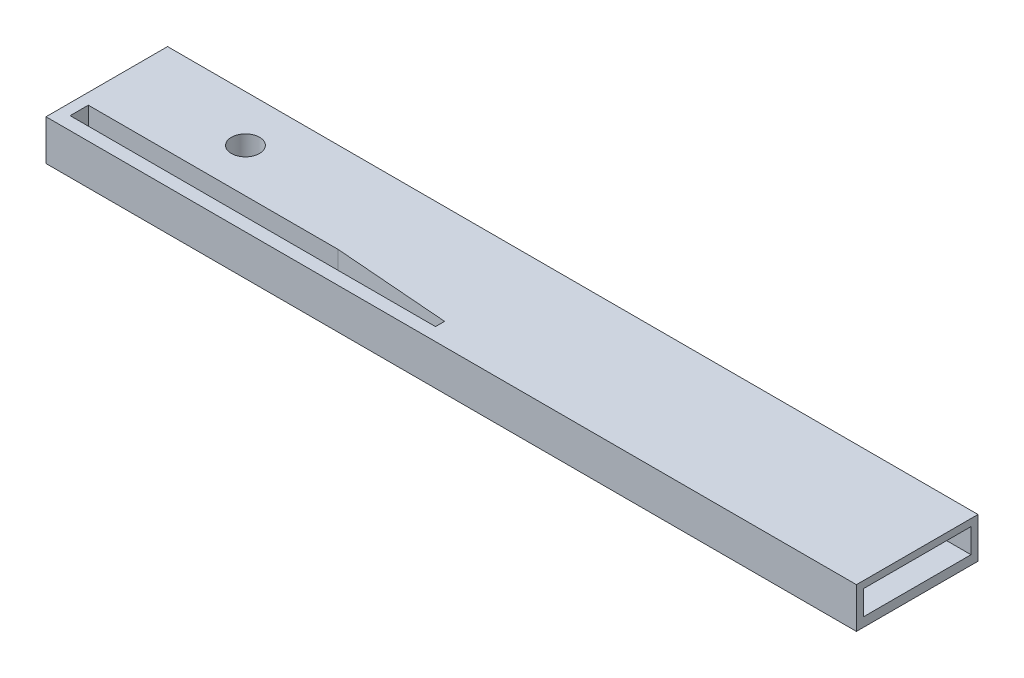
ISO-10303-21;
HEADER;
FILE_DESCRIPTION(('STEP AP214'),'2;1');
FILE_NAME('part.step','',(''),(''),'','','');
FILE_SCHEMA(('AUTOMOTIVE_DESIGN { 1 0 10303 214 1 1 1 1 }'));
ENDSEC;
DATA;
#1=APPLICATION_CONTEXT('core data for automotive mechanical design processes');
#2=APPLICATION_PROTOCOL_DEFINITION('international standard','automotive_design',2000,#1);
#3=PRODUCT_CONTEXT('',#1,'mechanical');
#4=PRODUCT('Part','Part','',(#3));
#5=PRODUCT_RELATED_PRODUCT_CATEGORY('part','',(#4));
#6=PRODUCT_DEFINITION_FORMATION('','',#4);
#7=PRODUCT_DEFINITION_CONTEXT('part definition',#1,'design');
#8=PRODUCT_DEFINITION('design','',#6,#7);
#9=PRODUCT_DEFINITION_SHAPE('','',#8);
#10=(LENGTH_UNIT() NAMED_UNIT(*) SI_UNIT(.MILLI.,.METRE.));
#11=(NAMED_UNIT(*) PLANE_ANGLE_UNIT() SI_UNIT($,.RADIAN.));
#12=(NAMED_UNIT(*) SI_UNIT($,.STERADIAN.) SOLID_ANGLE_UNIT());
#13=UNCERTAINTY_MEASURE_WITH_UNIT(LENGTH_MEASURE(1.E-05),#10,'distance_accuracy_value','');
#14=(GEOMETRIC_REPRESENTATION_CONTEXT(3) GLOBAL_UNCERTAINTY_ASSIGNED_CONTEXT((#13)) GLOBAL_UNIT_ASSIGNED_CONTEXT((#10,
#11,#12)) REPRESENTATION_CONTEXT('',''));
#15=CARTESIAN_POINT('',(0.,0.,0.));
#16=DIRECTION('',(0.,0.,1.));
#17=DIRECTION('',(1.,0.,0.));
#18=AXIS2_PLACEMENT_3D('',#15,#16,#17);
#19=CARTESIAN_POINT('',(63.5,6.35,-9.525));
#20=DIRECTION('',(-1.,0.,0.));
#21=DIRECTION('',(0.,0.,1.));
#22=AXIS2_PLACEMENT_3D('',#19,#20,#21);
#23=PLANE('',#22);
#24=DIRECTION('',(0.,0.,1.));
#25=VECTOR('',#24,1.);
#26=CARTESIAN_POINT('',(63.5,5.25234773855068,8.42866450856745));
#27=LINE('',#26,#25);
#28=CARTESIAN_POINT('',(63.5,5.25234773855068,-8.42866450856745));
#29=VERTEX_POINT('',#28);
#30=CARTESIAN_POINT('',(63.5,5.25234773855068,8.42866450856745));
#31=VERTEX_POINT('',#30);
#32=EDGE_CURVE('E191',#29,#31,#27,.T.);
#33=ORIENTED_EDGE('',*,*,#32,.F.);
#34=DIRECTION('',(0.,1.,0.));
#35=VECTOR('',#34,1.);
#36=CARTESIAN_POINT('',(63.5,5.25234773855068,-8.42866450856745));
#37=LINE('',#36,#35);
#38=CARTESIAN_POINT('',(63.5,1.43559399882202,-8.42866450856745));
#39=VERTEX_POINT('',#38);
#40=EDGE_CURVE('E170',#39,#29,#37,.T.);
#41=ORIENTED_EDGE('',*,*,#40,.F.);
#42=DIRECTION('',(0.,0.,-1.));
#43=VECTOR('',#42,1.);
#44=CARTESIAN_POINT('',(63.5,1.43559399882202,8.42866450856745));
#45=LINE('',#44,#43);
#46=CARTESIAN_POINT('',(63.5,1.43559399882202,8.42866450856745));
#47=VERTEX_POINT('',#46);
#48=EDGE_CURVE('E180',#47,#39,#45,.T.);
#49=ORIENTED_EDGE('',*,*,#48,.F.);
#50=DIRECTION('',(0.,-1.,0.));
#51=VECTOR('',#50,1.);
#52=CARTESIAN_POINT('',(63.5,5.25234773855068,8.42866450856745));
#53=LINE('',#52,#51);
#54=EDGE_CURVE('E194',#31,#47,#53,.T.);
#55=ORIENTED_EDGE('',*,*,#54,.F.);
#56=EDGE_LOOP('',(#33,#41,#49,#55));
#57=FACE_BOUND('',#56,.T.);
#58=DIRECTION('',(0.,0.,-1.));
#59=VECTOR('',#58,1.);
#60=CARTESIAN_POINT('',(63.5,0.,-9.525));
#61=LINE('',#60,#59);
#62=CARTESIAN_POINT('',(63.5,0.,9.525));
#63=VERTEX_POINT('',#62);
#64=CARTESIAN_POINT('',(63.5,0.,-9.525));
#65=VERTEX_POINT('',#64);
#66=EDGE_CURVE('E201',#63,#65,#61,.T.);
#67=ORIENTED_EDGE('',*,*,#66,.T.);
#68=DIRECTION('',(0.,-1.,0.));
#69=VECTOR('',#68,1.);
#70=CARTESIAN_POINT('',(63.5,6.35,-9.525));
#71=LINE('',#70,#69);
#72=CARTESIAN_POINT('',(63.5,6.35,-9.525));
#73=VERTEX_POINT('',#72);
#74=EDGE_CURVE('E11',#73,#65,#71,.T.);
#75=ORIENTED_EDGE('',*,*,#74,.F.);
#76=DIRECTION('',(0.,0.,-1.));
#77=VECTOR('',#76,1.);
#78=CARTESIAN_POINT('',(63.5,6.35,-9.525));
#79=LINE('',#78,#77);
#80=CARTESIAN_POINT('',(63.5,6.35,9.525));
#81=VERTEX_POINT('',#80);
#82=EDGE_CURVE('E208',#81,#73,#79,.T.);
#83=ORIENTED_EDGE('',*,*,#82,.F.);
#84=DIRECTION('',(0.,-1.,0.));
#85=VECTOR('',#84,1.);
#86=CARTESIAN_POINT('',(63.5,6.35,9.525));
#87=LINE('',#86,#85);
#88=EDGE_CURVE('E218',#81,#63,#87,.T.);
#89=ORIENTED_EDGE('',*,*,#88,.T.);
#90=EDGE_LOOP('',(#67,#75,#83,#89));
#91=FACE_BOUND('',#90,.T.);
#92=ADVANCED_FACE('F33',(#57,#91),#23,.F.);
#93=CARTESIAN_POINT('',(-63.5,6.35,-9.525));
#94=DIRECTION('',(0.,0.,1.));
#95=DIRECTION('',(1.,0.,0.));
#96=AXIS2_PLACEMENT_3D('',#93,#94,#95);
#97=PLANE('',#96);
#98=DIRECTION('',(-1.,0.,0.));
#99=VECTOR('',#98,1.);
#100=CARTESIAN_POINT('',(-63.5,0.,-9.525));
#101=LINE('',#100,#99);
#102=CARTESIAN_POINT('',(-63.5,0.,-9.525));
#103=VERTEX_POINT('',#102);
#104=EDGE_CURVE('E221',#65,#103,#101,.T.);
#105=ORIENTED_EDGE('',*,*,#104,.T.);
#106=DIRECTION('',(0.,-1.,0.));
#107=VECTOR('',#106,1.);
#108=CARTESIAN_POINT('',(-63.5,6.35,-9.525));
#109=LINE('',#108,#107);
#110=CARTESIAN_POINT('',(-63.5,6.35,-9.525));
#111=VERTEX_POINT('',#110);
#112=EDGE_CURVE('E40',#111,#103,#109,.T.);
#113=ORIENTED_EDGE('',*,*,#112,.F.);
#114=DIRECTION('',(-1.,0.,0.));
#115=VECTOR('',#114,1.);
#116=CARTESIAN_POINT('',(-63.5,6.35,-9.525));
#117=LINE('',#116,#115);
#118=EDGE_CURVE('E211',#73,#111,#117,.T.);
#119=ORIENTED_EDGE('',*,*,#118,.F.);
#120=ORIENTED_EDGE('',*,*,#74,.T.);
#121=EDGE_LOOP('',(#105,#113,#119,#120));
#122=FACE_BOUND('',#121,.T.);
#123=ADVANCED_FACE('F249',(#122),#97,.F.);
#124=CARTESIAN_POINT('',(-63.5,6.35,-9.525));
#125=DIRECTION('',(1.,0.,0.));
#126=DIRECTION('',(0.,0.,-1.));
#127=AXIS2_PLACEMENT_3D('',#124,#125,#126);
#128=PLANE('',#127);
#129=DIRECTION('',(0.,0.,1.));
#130=VECTOR('',#129,1.);
#131=CARTESIAN_POINT('',(-63.5,0.,-9.525));
#132=LINE('',#131,#130);
#133=CARTESIAN_POINT('',(-63.5,0.,9.525));
#134=VERTEX_POINT('',#133);
#135=EDGE_CURVE('E223',#103,#134,#132,.T.);
#136=ORIENTED_EDGE('',*,*,#135,.T.);
#137=DIRECTION('',(0.,-1.,0.));
#138=VECTOR('',#137,1.);
#139=CARTESIAN_POINT('',(-63.5,6.35,9.525));
#140=LINE('',#139,#138);
#141=CARTESIAN_POINT('',(-63.5,6.35,9.525));
#142=VERTEX_POINT('',#141);
#143=EDGE_CURVE('E228',#142,#134,#140,.T.);
#144=ORIENTED_EDGE('',*,*,#143,.F.);
#145=DIRECTION('',(0.,0.,1.));
#146=VECTOR('',#145,1.);
#147=CARTESIAN_POINT('',(-63.5,6.35,-9.525));
#148=LINE('',#147,#146);
#149=EDGE_CURVE('E214',#111,#142,#148,.T.);
#150=ORIENTED_EDGE('',*,*,#149,.F.);
#151=ORIENTED_EDGE('',*,*,#112,.T.);
#152=EDGE_LOOP('',(#136,#144,#150,#151));
#153=FACE_BOUND('',#152,.T.);
#154=ADVANCED_FACE('F235',(#153),#128,.F.);
#155=CARTESIAN_POINT('',(-63.5,6.35,9.525));
#156=DIRECTION('',(0.,0.,-1.));
#157=DIRECTION('',(-1.,0.,0.));
#158=AXIS2_PLACEMENT_3D('',#155,#156,#157);
#159=PLANE('',#158);
#160=DIRECTION('',(1.,0.,0.));
#161=VECTOR('',#160,1.);
#162=CARTESIAN_POINT('',(-63.5,0.,9.525));
#163=LINE('',#162,#161);
#164=EDGE_CURVE('E212',#134,#63,#163,.T.);
#165=ORIENTED_EDGE('',*,*,#164,.T.);
#166=ORIENTED_EDGE('',*,*,#88,.F.);
#167=DIRECTION('',(1.,0.,0.));
#168=VECTOR('',#167,1.);
#169=CARTESIAN_POINT('',(-63.5,6.35,9.525));
#170=LINE('',#169,#168);
#171=EDGE_CURVE('E216',#142,#81,#170,.T.);
#172=ORIENTED_EDGE('',*,*,#171,.F.);
#173=ORIENTED_EDGE('',*,*,#143,.T.);
#174=EDGE_LOOP('',(#165,#166,#172,#173));
#175=FACE_BOUND('',#174,.T.);
#176=ADVANCED_FACE('F242',(#175),#159,.F.);
#177=CARTESIAN_POINT('',(0.,6.35,0.));
#178=DIRECTION('',(0.,1.,0.));
#179=DIRECTION('',(0.,0.,1.));
#180=AXIS2_PLACEMENT_3D('',#177,#178,#179);
#181=PLANE('',#180);
#182=CARTESIAN_POINT('',(-43.9861623077586,6.35,-2.21493744615281));
#183=DIRECTION('',(0.,1.,0.));
#184=DIRECTION('',(0.,0.,1.));
#185=AXIS2_PLACEMENT_3D('',#182,#183,#184);
#186=CIRCLE('',#185,2.20805835631743);
#187=CARTESIAN_POINT('',(-43.9861623077586,6.35,-0.00687908983537482));
#188=VERTEX_POINT('',#187);
#189=EDGE_CURVE('E152',#188,#188,#186,.T.);
#190=ORIENTED_EDGE('',*,*,#189,.F.);
#191=EDGE_LOOP('',(#190));
#192=FACE_BOUND('',#191,.T.);
#193=DIRECTION('',(0.,0.,1.));
#194=VECTOR('',#193,1.);
#195=CARTESIAN_POINT('',(-61.757195927554,6.35,4.6364283922186));
#196=LINE('',#195,#194);
#197=CARTESIAN_POINT('',(-61.757195927554,6.35,4.6364283922186));
#198=VERTEX_POINT('',#197);
#199=CARTESIAN_POINT('',(-61.757195927554,6.35,7.48772869078711));
#200=VERTEX_POINT('',#199);
#201=EDGE_CURVE('E47',#198,#200,#196,.T.);
#202=ORIENTED_EDGE('',*,*,#201,.F.);
#203=DIRECTION('',(-1.,0.,0.));
#204=VECTOR('',#203,1.);
#205=CARTESIAN_POINT('',(-61.757195927554,6.35,4.6364283922186));
#206=LINE('',#205,#204);
#207=CARTESIAN_POINT('',(-22.6377135339533,6.35,4.6364283922186));
#208=VERTEX_POINT('',#207);
#209=EDGE_CURVE('E146',#208,#198,#206,.T.);
#210=ORIENTED_EDGE('',*,*,#209,.F.);
#211=DIRECTION('',(-0.996923159602342,0.,-0.0783850358709056));
#212=VECTOR('',#211,1.);
#213=CARTESIAN_POINT('',(-22.6377135339533,6.35,4.6364283922186));
#214=LINE('',#213,#212);
#215=CARTESIAN_POINT('',(-4.50588983162409,6.35,6.06207854150285));
#216=VERTEX_POINT('',#215);
#217=EDGE_CURVE('E149',#216,#208,#214,.T.);
#218=ORIENTED_EDGE('',*,*,#217,.F.);
#219=DIRECTION('',(0.,0.,-1.));
#220=VECTOR('',#219,1.);
#221=CARTESIAN_POINT('',(-4.50588983162409,6.35,6.06207854150285));
#222=LINE('',#221,#220);
#223=CARTESIAN_POINT('',(-4.50588983162409,6.35,7.48772869078711));
#224=VERTEX_POINT('',#223);
#225=EDGE_CURVE('E163',#224,#216,#222,.T.);
#226=ORIENTED_EDGE('',*,*,#225,.F.);
#227=DIRECTION('',(1.,0.,0.));
#228=VECTOR('',#227,1.);
#229=CARTESIAN_POINT('',(-61.757195927554,6.35,7.48772869078711));
#230=LINE('',#229,#228);
#231=EDGE_CURVE('E160',#200,#224,#230,.T.);
#232=ORIENTED_EDGE('',*,*,#231,.F.);
#233=EDGE_LOOP('',(#202,#210,#218,#226,#232));
#234=FACE_BOUND('',#233,.T.);
#235=ORIENTED_EDGE('',*,*,#82,.T.);
#236=ORIENTED_EDGE('',*,*,#118,.T.);
#237=ORIENTED_EDGE('',*,*,#149,.T.);
#238=ORIENTED_EDGE('',*,*,#171,.T.);
#239=EDGE_LOOP('',(#235,#236,#237,#238));
#240=FACE_BOUND('',#239,.T.);
#241=ADVANCED_FACE('F248',(#192,#234,#240),#181,.T.);
#242=CARTESIAN_POINT('',(0.,0.,0.));
#243=DIRECTION('',(0.,1.,0.));
#244=DIRECTION('',(0.,0.,1.));
#245=AXIS2_PLACEMENT_3D('',#242,#243,#244);
#246=PLANE('',#245);
#247=CARTESIAN_POINT('',(-43.9861623077586,0.,-2.21493744615281));
#248=DIRECTION('',(0.,1.,0.));
#249=DIRECTION('',(0.,0.,1.));
#250=AXIS2_PLACEMENT_3D('',#247,#248,#249);
#251=CIRCLE('',#250,2.20805835631743);
#252=CARTESIAN_POINT('',(-43.9861623077586,0.,-0.00687908983537482));
#253=VERTEX_POINT('',#252);
#254=EDGE_CURVE('E161',#253,#253,#251,.T.);
#255=ORIENTED_EDGE('',*,*,#254,.T.);
#256=EDGE_LOOP('',(#255));
#257=FACE_BOUND('',#256,.T.);
#258=DIRECTION('',(-1.,0.,0.));
#259=VECTOR('',#258,1.);
#260=CARTESIAN_POINT('',(-61.757195927554,0.,4.6364283922186));
#261=LINE('',#260,#259);
#262=CARTESIAN_POINT('',(-22.6377135339533,0.,4.6364283922186));
#263=VERTEX_POINT('',#262);
#264=CARTESIAN_POINT('',(-61.757195927554,0.,4.6364283922186));
#265=VERTEX_POINT('',#264);
#266=EDGE_CURVE('E135',#263,#265,#261,.T.);
#267=ORIENTED_EDGE('',*,*,#266,.T.);
#268=DIRECTION('',(0.,0.,1.));
#269=VECTOR('',#268,1.);
#270=CARTESIAN_POINT('',(-61.757195927554,0.,4.6364283922186));
#271=LINE('',#270,#269);
#272=CARTESIAN_POINT('',(-61.757195927554,0.,7.48772869078711));
#273=VERTEX_POINT('',#272);
#274=EDGE_CURVE('E129',#265,#273,#271,.T.);
#275=ORIENTED_EDGE('',*,*,#274,.T.);
#276=DIRECTION('',(1.,0.,0.));
#277=VECTOR('',#276,1.);
#278=CARTESIAN_POINT('',(-61.757195927554,0.,7.48772869078711));
#279=LINE('',#278,#277);
#280=CARTESIAN_POINT('',(-4.50588983162409,0.,7.48772869078711));
#281=VERTEX_POINT('',#280);
#282=EDGE_CURVE('E138',#273,#281,#279,.T.);
#283=ORIENTED_EDGE('',*,*,#282,.T.);
#284=DIRECTION('',(0.,0.,-1.));
#285=VECTOR('',#284,1.);
#286=CARTESIAN_POINT('',(-4.50588983162409,0.,6.06207854150285));
#287=LINE('',#286,#285);
#288=CARTESIAN_POINT('',(-4.50588983162409,0.,6.06207854150285));
#289=VERTEX_POINT('',#288);
#290=EDGE_CURVE('E55',#281,#289,#287,.T.);
#291=ORIENTED_EDGE('',*,*,#290,.T.);
#292=DIRECTION('',(-0.996923159602342,0.,-0.0783850358709056));
#293=VECTOR('',#292,1.);
#294=CARTESIAN_POINT('',(-22.6377135339533,0.,4.6364283922186));
#295=LINE('',#294,#293);
#296=EDGE_CURVE('E156',#289,#263,#295,.T.);
#297=ORIENTED_EDGE('',*,*,#296,.T.);
#298=EDGE_LOOP('',(#267,#275,#283,#291,#297));
#299=FACE_BOUND('',#298,.T.);
#300=ORIENTED_EDGE('',*,*,#66,.F.);
#301=ORIENTED_EDGE('',*,*,#164,.F.);
#302=ORIENTED_EDGE('',*,*,#135,.F.);
#303=ORIENTED_EDGE('',*,*,#104,.F.);
#304=EDGE_LOOP('',(#300,#301,#302,#303));
#305=FACE_BOUND('',#304,.T.);
#306=ADVANCED_FACE('F142',(#257,#299,#305),#246,.F.);
#307=CARTESIAN_POINT('',(57.15,5.25234773855068,-8.42866450856745));
#308=DIRECTION('',(0.,0.,-1.));
#309=DIRECTION('',(-1.,0.,0.));
#310=AXIS2_PLACEMENT_3D('',#307,#308,#309);
#311=PLANE('',#310);
#312=ORIENTED_EDGE('',*,*,#40,.T.);
#313=DIRECTION('',(1.,0.,0.));
#314=VECTOR('',#313,1.);
#315=CARTESIAN_POINT('',(57.15,5.25234773855068,-8.42866450856745));
#316=LINE('',#315,#314);
#317=CARTESIAN_POINT('',(57.15,5.25234773855068,-8.42866450856745));
#318=VERTEX_POINT('',#317);
#319=EDGE_CURVE('E189',#318,#29,#316,.T.);
#320=ORIENTED_EDGE('',*,*,#319,.F.);
#321=DIRECTION('',(0.,1.,0.));
#322=VECTOR('',#321,1.);
#323=CARTESIAN_POINT('',(57.15,5.25234773855068,-8.42866450856745));
#324=LINE('',#323,#322);
#325=CARTESIAN_POINT('',(57.15,1.43559399882202,-8.42866450856745));
#326=VERTEX_POINT('',#325);
#327=EDGE_CURVE('E176',#326,#318,#324,.T.);
#328=ORIENTED_EDGE('',*,*,#327,.F.);
#329=DIRECTION('',(1.,0.,0.));
#330=VECTOR('',#329,1.);
#331=CARTESIAN_POINT('',(57.15,1.43559399882202,-8.42866450856745));
#332=LINE('',#331,#330);
#333=EDGE_CURVE('E199',#326,#39,#332,.T.);
#334=ORIENTED_EDGE('',*,*,#333,.T.);
#335=EDGE_LOOP('',(#312,#320,#328,#334));
#336=FACE_BOUND('',#335,.T.);
#337=ADVANCED_FACE('F262',(#336),#311,.F.);
#338=CARTESIAN_POINT('',(57.15,1.43559399882202,8.42866450856745));
#339=DIRECTION('',(0.,-1.,0.));
#340=DIRECTION('',(0.,0.,-1.));
#341=AXIS2_PLACEMENT_3D('',#338,#339,#340);
#342=PLANE('',#341);
#343=ORIENTED_EDGE('',*,*,#48,.T.);
#344=ORIENTED_EDGE('',*,*,#333,.F.);
#345=DIRECTION('',(0.,0.,-1.));
#346=VECTOR('',#345,1.);
#347=CARTESIAN_POINT('',(57.15,1.43559399882202,8.42866450856745));
#348=LINE('',#347,#346);
#349=CARTESIAN_POINT('',(57.15,1.43559399882202,8.42866450856745));
#350=VERTEX_POINT('',#349);
#351=EDGE_CURVE('E186',#350,#326,#348,.T.);
#352=ORIENTED_EDGE('',*,*,#351,.F.);
#353=DIRECTION('',(1.,0.,0.));
#354=VECTOR('',#353,1.);
#355=CARTESIAN_POINT('',(57.15,1.43559399882202,8.42866450856745));
#356=LINE('',#355,#354);
#357=EDGE_CURVE('E202',#350,#47,#356,.T.);
#358=ORIENTED_EDGE('',*,*,#357,.T.);
#359=EDGE_LOOP('',(#343,#344,#352,#358));
#360=FACE_BOUND('',#359,.T.);
#361=ADVANCED_FACE('F269',(#360),#342,.F.);
#362=CARTESIAN_POINT('',(57.15,5.25234773855068,8.42866450856745));
#363=DIRECTION('',(0.,0.,1.));
#364=DIRECTION('',(1.,0.,0.));
#365=AXIS2_PLACEMENT_3D('',#362,#363,#364);
#366=PLANE('',#365);
#367=ORIENTED_EDGE('',*,*,#54,.T.);
#368=ORIENTED_EDGE('',*,*,#357,.F.);
#369=DIRECTION('',(0.,-1.,0.));
#370=VECTOR('',#369,1.);
#371=CARTESIAN_POINT('',(57.15,5.25234773855068,8.42866450856745));
#372=LINE('',#371,#370);
#373=CARTESIAN_POINT('',(57.15,5.25234773855068,8.42866450856745));
#374=VERTEX_POINT('',#373);
#375=EDGE_CURVE('E183',#374,#350,#372,.T.);
#376=ORIENTED_EDGE('',*,*,#375,.F.);
#377=DIRECTION('',(1.,0.,0.));
#378=VECTOR('',#377,1.);
#379=CARTESIAN_POINT('',(57.15,5.25234773855068,8.42866450856745));
#380=LINE('',#379,#378);
#381=EDGE_CURVE('E204',#374,#31,#380,.T.);
#382=ORIENTED_EDGE('',*,*,#381,.T.);
#383=EDGE_LOOP('',(#367,#368,#376,#382));
#384=FACE_BOUND('',#383,.T.);
#385=ADVANCED_FACE('F275',(#384),#366,.F.);
#386=CARTESIAN_POINT('',(57.15,5.25234773855068,8.42866450856745));
#387=DIRECTION('',(0.,1.,0.));
#388=DIRECTION('',(0.,0.,1.));
#389=AXIS2_PLACEMENT_3D('',#386,#387,#388);
#390=PLANE('',#389);
#391=ORIENTED_EDGE('',*,*,#32,.T.);
#392=ORIENTED_EDGE('',*,*,#381,.F.);
#393=DIRECTION('',(0.,0.,1.));
#394=VECTOR('',#393,1.);
#395=CARTESIAN_POINT('',(57.15,5.25234773855068,8.42866450856745));
#396=LINE('',#395,#394);
#397=EDGE_CURVE('E179',#318,#374,#396,.T.);
#398=ORIENTED_EDGE('',*,*,#397,.F.);
#399=ORIENTED_EDGE('',*,*,#319,.T.);
#400=EDGE_LOOP('',(#391,#392,#398,#399));
#401=FACE_BOUND('',#400,.T.);
#402=ADVANCED_FACE('F271',(#401),#390,.F.);
#403=CARTESIAN_POINT('',(57.15,0.,0.));
#404=DIRECTION('',(1.,0.,0.));
#405=DIRECTION('',(0.,0.,-1.));
#406=AXIS2_PLACEMENT_3D('',#403,#404,#405);
#407=PLANE('',#406);
#408=ORIENTED_EDGE('',*,*,#327,.T.);
#409=ORIENTED_EDGE('',*,*,#397,.T.);
#410=ORIENTED_EDGE('',*,*,#375,.T.);
#411=ORIENTED_EDGE('',*,*,#351,.T.);
#412=EDGE_LOOP('',(#408,#409,#410,#411));
#413=FACE_BOUND('',#412,.T.);
#414=ADVANCED_FACE('F274',(#413),#407,.T.);
#415=CARTESIAN_POINT('',(-61.757195927554,0.,4.6364283922186));
#416=DIRECTION('',(-1.,0.,0.));
#417=DIRECTION('',(0.,0.,1.));
#418=AXIS2_PLACEMENT_3D('',#415,#416,#417);
#419=PLANE('',#418);
#420=ORIENTED_EDGE('',*,*,#201,.T.);
#421=DIRECTION('',(0.,1.,0.));
#422=VECTOR('',#421,1.);
#423=CARTESIAN_POINT('',(-61.757195927554,0.,7.48772869078711));
#424=LINE('',#423,#422);
#425=EDGE_CURVE('E125',#273,#200,#424,.T.);
#426=ORIENTED_EDGE('',*,*,#425,.F.);
#427=ORIENTED_EDGE('',*,*,#274,.F.);
#428=DIRECTION('',(0.,1.,0.));
#429=VECTOR('',#428,1.);
#430=CARTESIAN_POINT('',(-61.757195927554,0.,4.6364283922186));
#431=LINE('',#430,#429);
#432=EDGE_CURVE('E168',#265,#198,#431,.T.);
#433=ORIENTED_EDGE('',*,*,#432,.T.);
#434=EDGE_LOOP('',(#420,#426,#427,#433));
#435=FACE_BOUND('',#434,.T.);
#436=ADVANCED_FACE('F127',(#435),#419,.F.);
#437=CARTESIAN_POINT('',(-61.757195927554,0.,4.6364283922186));
#438=DIRECTION('',(0.,0.,-1.));
#439=DIRECTION('',(-1.,0.,0.));
#440=AXIS2_PLACEMENT_3D('',#437,#438,#439);
#441=PLANE('',#440);
#442=ORIENTED_EDGE('',*,*,#209,.T.);
#443=ORIENTED_EDGE('',*,*,#432,.F.);
#444=ORIENTED_EDGE('',*,*,#266,.F.);
#445=DIRECTION('',(0.,1.,0.));
#446=VECTOR('',#445,1.);
#447=CARTESIAN_POINT('',(-22.6377135339533,0.,4.6364283922186));
#448=LINE('',#447,#446);
#449=EDGE_CURVE('E171',#263,#208,#448,.T.);
#450=ORIENTED_EDGE('',*,*,#449,.T.);
#451=EDGE_LOOP('',(#442,#443,#444,#450));
#452=FACE_BOUND('',#451,.T.);
#453=ADVANCED_FACE('F288',(#452),#441,.F.);
#454=CARTESIAN_POINT('',(-22.6377135339533,0.,4.6364283922186));
#455=DIRECTION('',(0.0783850358709056,0.,-0.996923159602342));
#456=DIRECTION('',(-0.996923159602342,0.,-0.0783850358709056));
#457=AXIS2_PLACEMENT_3D('',#454,#455,#456);
#458=PLANE('',#457);
#459=ORIENTED_EDGE('',*,*,#217,.T.);
#460=ORIENTED_EDGE('',*,*,#449,.F.);
#461=ORIENTED_EDGE('',*,*,#296,.F.);
#462=DIRECTION('',(0.,1.,0.));
#463=VECTOR('',#462,1.);
#464=CARTESIAN_POINT('',(-4.50588983162409,0.,6.06207854150285));
#465=LINE('',#464,#463);
#466=EDGE_CURVE('E173',#289,#216,#465,.T.);
#467=ORIENTED_EDGE('',*,*,#466,.T.);
#468=EDGE_LOOP('',(#459,#460,#461,#467));
#469=FACE_BOUND('',#468,.T.);
#470=ADVANCED_FACE('F295',(#469),#458,.F.);
#471=CARTESIAN_POINT('',(-4.50588983162409,0.,6.06207854150285));
#472=DIRECTION('',(1.,0.,0.));
#473=DIRECTION('',(0.,0.,-1.));
#474=AXIS2_PLACEMENT_3D('',#471,#472,#473);
#475=PLANE('',#474);
#476=ORIENTED_EDGE('',*,*,#225,.T.);
#477=ORIENTED_EDGE('',*,*,#466,.F.);
#478=ORIENTED_EDGE('',*,*,#290,.F.);
#479=DIRECTION('',(0.,1.,0.));
#480=VECTOR('',#479,1.);
#481=CARTESIAN_POINT('',(-4.50588983162409,0.,7.48772869078711));
#482=LINE('',#481,#480);
#483=EDGE_CURVE('E134',#281,#224,#482,.T.);
#484=ORIENTED_EDGE('',*,*,#483,.T.);
#485=EDGE_LOOP('',(#476,#477,#478,#484));
#486=FACE_BOUND('',#485,.T.);
#487=ADVANCED_FACE('F292',(#486),#475,.F.);
#488=CARTESIAN_POINT('',(-61.757195927554,0.,7.48772869078711));
#489=DIRECTION('',(0.,0.,1.));
#490=DIRECTION('',(1.,0.,0.));
#491=AXIS2_PLACEMENT_3D('',#488,#489,#490);
#492=PLANE('',#491);
#493=ORIENTED_EDGE('',*,*,#231,.T.);
#494=ORIENTED_EDGE('',*,*,#483,.F.);
#495=ORIENTED_EDGE('',*,*,#282,.F.);
#496=ORIENTED_EDGE('',*,*,#425,.T.);
#497=EDGE_LOOP('',(#493,#494,#495,#496));
#498=FACE_BOUND('',#497,.T.);
#499=ADVANCED_FACE('F139',(#498),#492,.F.);
#500=CARTESIAN_POINT('',(-43.9861623077586,0.,-2.21493744615281));
#501=DIRECTION('',(0.,1.,0.));
#502=DIRECTION('',(0.,0.,1.));
#503=AXIS2_PLACEMENT_3D('',#500,#501,#502);
#504=CYLINDRICAL_SURFACE('',#503,2.20805835631743);
#505=ORIENTED_EDGE('',*,*,#254,.F.);
#506=EDGE_LOOP('',(#505));
#507=FACE_BOUND('',#506,.T.);
#508=ORIENTED_EDGE('',*,*,#189,.T.);
#509=EDGE_LOOP('',(#508));
#510=FACE_BOUND('',#509,.T.);
#511=ADVANCED_FACE('F291',(#507,#510),#504,.F.);
#512=CLOSED_SHELL('',(#92,#123,#154,#176,#241,#306,#337,#361,#385,#402,#414,#436,#453,#470,#487,
#499,#511));
#513=MANIFOLD_SOLID_BREP('B2',#512);
#514=ADVANCED_BREP_SHAPE_REPRESENTATION('',(#18,#513),#14);
#515=SHAPE_DEFINITION_REPRESENTATION(#9,#514);
ENDSEC;
END-ISO-10303-21;
